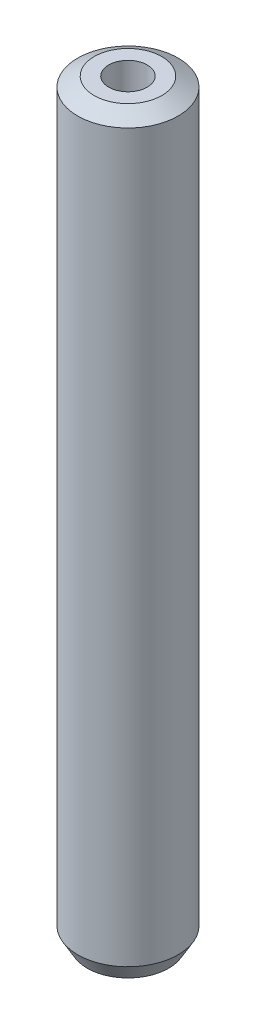
ISO-10303-21;
HEADER;
FILE_DESCRIPTION(('STEP AP214'),'2;1');
FILE_NAME('part.step','',(''),(''),'','','');
FILE_SCHEMA(('AUTOMOTIVE_DESIGN { 1 0 10303 214 1 1 1 1 }'));
ENDSEC;
DATA;
#1=APPLICATION_CONTEXT('core data for automotive mechanical design processes');
#2=APPLICATION_PROTOCOL_DEFINITION('international standard','automotive_design',2000,#1);
#3=PRODUCT_CONTEXT('',#1,'mechanical');
#4=PRODUCT('Part','Part','',(#3));
#5=PRODUCT_RELATED_PRODUCT_CATEGORY('part','',(#4));
#6=PRODUCT_DEFINITION_FORMATION('','',#4);
#7=PRODUCT_DEFINITION_CONTEXT('part definition',#1,'design');
#8=PRODUCT_DEFINITION('design','',#6,#7);
#9=PRODUCT_DEFINITION_SHAPE('','',#8);
#10=(LENGTH_UNIT() NAMED_UNIT(*) SI_UNIT(.MILLI.,.METRE.));
#11=(NAMED_UNIT(*) PLANE_ANGLE_UNIT() SI_UNIT($,.RADIAN.));
#12=(NAMED_UNIT(*) SI_UNIT($,.STERADIAN.) SOLID_ANGLE_UNIT());
#13=UNCERTAINTY_MEASURE_WITH_UNIT(LENGTH_MEASURE(1.E-05),#10,'distance_accuracy_value','');
#14=(GEOMETRIC_REPRESENTATION_CONTEXT(3) GLOBAL_UNCERTAINTY_ASSIGNED_CONTEXT((#13)) GLOBAL_UNIT_ASSIGNED_CONTEXT((#10,
#11,#12)) REPRESENTATION_CONTEXT('',''));
#15=CARTESIAN_POINT('',(0.,0.,0.));
#16=DIRECTION('',(0.,0.,1.));
#17=DIRECTION('',(1.,0.,0.));
#18=AXIS2_PLACEMENT_3D('',#15,#16,#17);
#19=CARTESIAN_POINT('',(0.,74.863959418721,0.));
#20=DIRECTION('',(0.,-1.,0.));
#21=DIRECTION('',(0.,0.,-1.));
#22=AXIS2_PLACEMENT_3D('',#19,#20,#21);
#23=CYLINDRICAL_SURFACE('',#22,5.);
#24=CARTESIAN_POINT('',(0.,73.9192905775556,0.));
#25=DIRECTION('',(0.,1.,0.));
#26=DIRECTION('',(0.,0.,1.));
#27=AXIS2_PLACEMENT_3D('',#24,#25,#26);
#28=CIRCLE('',#27,5.);
#29=CARTESIAN_POINT('',(0.,73.9192905775556,5.));
#30=VERTEX_POINT('',#29);
#31=EDGE_CURVE('E50',#30,#30,#28,.F.);
#32=ORIENTED_EDGE('',*,*,#31,.T.);
#33=EDGE_LOOP('',(#32));
#34=FACE_BOUND('',#33,.T.);
#35=CARTESIAN_POINT('',(0.,1.63621442922553,0.));
#36=DIRECTION('',(0.,1.,0.));
#37=DIRECTION('',(0.,0.,1.));
#38=AXIS2_PLACEMENT_3D('',#35,#36,#37);
#39=CIRCLE('',#38,5.);
#40=CARTESIAN_POINT('',(0.,1.63621442922553,5.));
#41=VERTEX_POINT('',#40);
#42=EDGE_CURVE('E51',#41,#41,#39,.T.);
#43=ORIENTED_EDGE('',*,*,#42,.T.);
#44=EDGE_LOOP('',(#43));
#45=FACE_BOUND('',#44,.T.);
#46=ADVANCED_FACE('F39',(#34,#45),#23,.T.);
#47=CARTESIAN_POINT('',(0.,74.863959418721,0.));
#48=DIRECTION('',(0.,1.,0.));
#49=DIRECTION('',(0.,0.,1.));
#50=AXIS2_PLACEMENT_3D('',#47,#48,#49);
#51=PLANE('',#50);
#52=CARTESIAN_POINT('',(0.,74.863959418721,0.));
#53=DIRECTION('',(0.,1.,0.));
#54=DIRECTION('',(0.,0.,1.));
#55=AXIS2_PLACEMENT_3D('',#52,#53,#54);
#56=CIRCLE('',#55,3.36378557077442);
#57=CARTESIAN_POINT('',(0.,74.863959418721,3.36378557077442));
#58=VERTEX_POINT('',#57);
#59=EDGE_CURVE('E54',#58,#58,#56,.T.);
#60=ORIENTED_EDGE('',*,*,#59,.T.);
#61=EDGE_LOOP('',(#60));
#62=FACE_BOUND('',#61,.T.);
#63=CARTESIAN_POINT('',(0.,74.863959418721,0.));
#64=DIRECTION('',(0.,1.,0.));
#65=DIRECTION('',(0.,0.,1.));
#66=AXIS2_PLACEMENT_3D('',#63,#64,#65);
#67=CIRCLE('',#66,1.91867223052026);
#68=CARTESIAN_POINT('',(0.,74.863959418721,1.91867223052026));
#69=VERTEX_POINT('',#68);
#70=EDGE_CURVE('E58',#69,#69,#67,.T.);
#71=ORIENTED_EDGE('',*,*,#70,.F.);
#72=EDGE_LOOP('',(#71));
#73=FACE_BOUND('',#72,.T.);
#74=ADVANCED_FACE('F69',(#62,#73),#51,.T.);
#75=CARTESIAN_POINT('',(0.,0.,0.));
#76=DIRECTION('',(0.,1.,0.));
#77=DIRECTION('',(0.,0.,1.));
#78=AXIS2_PLACEMENT_3D('',#75,#76,#77);
#79=PLANE('',#78);
#80=CARTESIAN_POINT('',(0.,0.,0.));
#81=DIRECTION('',(0.,1.,0.));
#82=DIRECTION('',(0.,0.,1.));
#83=AXIS2_PLACEMENT_3D('',#80,#81,#82);
#84=CIRCLE('',#83,4.05533115883468);
#85=CARTESIAN_POINT('',(0.,0.,4.05533115883468));
#86=VERTEX_POINT('',#85);
#87=EDGE_CURVE('E10',#86,#86,#84,.F.);
#88=ORIENTED_EDGE('',*,*,#87,.T.);
#89=EDGE_LOOP('',(#88));
#90=FACE_BOUND('',#89,.T.);
#91=CARTESIAN_POINT('',(0.,0.,0.));
#92=DIRECTION('',(0.,1.,0.));
#93=DIRECTION('',(0.,0.,1.));
#94=AXIS2_PLACEMENT_3D('',#91,#92,#93);
#95=CIRCLE('',#94,1.91867223052026);
#96=CARTESIAN_POINT('',(0.,0.,1.91867223052026));
#97=VERTEX_POINT('',#96);
#98=EDGE_CURVE('E63',#97,#97,#95,.T.);
#99=ORIENTED_EDGE('',*,*,#98,.T.);
#100=EDGE_LOOP('',(#99));
#101=FACE_BOUND('',#100,.T.);
#102=ADVANCED_FACE('F75',(#90,#101),#79,.F.);
#103=CARTESIAN_POINT('',(0.,74.863959418721,0.));
#104=DIRECTION('',(0.,-1.,0.));
#105=DIRECTION('',(0.,0.,-1.));
#106=AXIS2_PLACEMENT_3D('',#103,#104,#105);
#107=CYLINDRICAL_SURFACE('',#106,1.91867223052026);
#108=ORIENTED_EDGE('',*,*,#70,.T.);
#109=EDGE_LOOP('',(#108));
#110=FACE_BOUND('',#109,.T.);
#111=ORIENTED_EDGE('',*,*,#98,.F.);
#112=EDGE_LOOP('',(#111));
#113=FACE_BOUND('',#112,.T.);
#114=ADVANCED_FACE('F70',(#110,#113),#107,.F.);
#115=CARTESIAN_POINT('',(0.,74.863959418721,0.));
#116=DIRECTION('',(0.,-1.,0.));
#117=DIRECTION('',(0.,0.,-1.));
#118=AXIS2_PLACEMENT_3D('',#115,#116,#117);
#119=CONICAL_SURFACE('',#118,3.36378557077442,1.0471975511966);
#120=ORIENTED_EDGE('',*,*,#31,.F.);
#121=EDGE_LOOP('',(#120));
#122=FACE_BOUND('',#121,.T.);
#123=ORIENTED_EDGE('',*,*,#59,.F.);
#124=EDGE_LOOP('',(#123));
#125=FACE_BOUND('',#124,.T.);
#126=ADVANCED_FACE('F81',(#122,#125),#119,.T.);
#127=CARTESIAN_POINT('',(0.,1.63621442922553,0.));
#128=DIRECTION('',(0.,1.,0.));
#129=DIRECTION('',(0.,0.,1.));
#130=AXIS2_PLACEMENT_3D('',#127,#128,#129);
#131=CONICAL_SURFACE('',#130,5.,0.523598775598303);
#132=CARTESIAN_POINT('',(0.,0.,4.05533115883468));
#133=CARTESIAN_POINT('',(0.,0.0170439003044324,4.06517145926349));
#134=CARTESIAN_POINT('',(0.,0.0340878006088649,4.07501175969229));
#135=CARTESIAN_POINT('',(0.,0.0681756012177301,4.09469236054991));
#136=CARTESIAN_POINT('',(0.,0.0852195015221626,4.10453266097871));
#137=CARTESIAN_POINT('',(0.,0.119307302131028,4.12421326183632));
#138=CARTESIAN_POINT('',(0.,0.13635120243546,4.13405356226513));
#139=CARTESIAN_POINT('',(0.,0.170439003044326,4.15373416312274));
#140=CARTESIAN_POINT('',(0.,0.187482903348758,4.16357446355154));
#141=CARTESIAN_POINT('',(0.,0.221570703957623,4.18325506440915));
#142=CARTESIAN_POINT('',(0.,0.238614604262056,4.19309536483796));
#143=CARTESIAN_POINT('',(0.,0.272702404870921,4.21277596569557));
#144=CARTESIAN_POINT('',(0.,0.289746305175354,4.22261626612437));
#145=CARTESIAN_POINT('',(0.,0.323834105784219,4.24229686698199));
#146=CARTESIAN_POINT('',(0.,0.340878006088651,4.25213716741079));
#147=CARTESIAN_POINT('',(0.,0.374965806697516,4.2718177682684));
#148=CARTESIAN_POINT('',(0.,0.392009707001949,4.28165806869721));
#149=CARTESIAN_POINT('',(0.,0.426097507610814,4.30133866955482));
#150=CARTESIAN_POINT('',(0.,0.443141407915247,4.31117896998362));
#151=CARTESIAN_POINT('',(0.,0.477229208524112,4.33085957084123));
#152=CARTESIAN_POINT('',(0.,0.494273108828545,4.34069987127004));
#153=CARTESIAN_POINT('',(0.,0.52836090943741,4.36038047212765));
#154=CARTESIAN_POINT('',(0.,0.545404809741842,4.37022077255646));
#155=CARTESIAN_POINT('',(0.,0.579492610350707,4.38990137341407));
#156=CARTESIAN_POINT('',(0.,0.59653651065514,4.39974167384287));
#157=CARTESIAN_POINT('',(0.,0.630624311264005,4.41942227470048));
#158=CARTESIAN_POINT('',(0.,0.647668211568438,4.42926257512929));
#159=CARTESIAN_POINT('',(0.,0.681756012177303,4.4489431759869));
#160=CARTESIAN_POINT('',(0.,0.698799912481735,4.4587834764157));
#161=CARTESIAN_POINT('',(0.,0.732887713090601,4.47846407727331));
#162=CARTESIAN_POINT('',(0.,0.749931613395033,4.48830437770212));
#163=CARTESIAN_POINT('',(0.,0.784019414003898,4.50798497855973));
#164=CARTESIAN_POINT('',(0.,0.801063314308331,4.51782527898854));
#165=CARTESIAN_POINT('',(0.,0.835151114917196,4.53750587984615));
#166=CARTESIAN_POINT('',(0.,0.852195015221629,4.54734618027495));
#167=CARTESIAN_POINT('',(0.,0.886282815830494,4.56702678113256));
#168=CARTESIAN_POINT('',(0.,0.903326716134926,4.57686708156137));
#169=CARTESIAN_POINT('',(0.,0.937414516743791,4.59654768241898));
#170=CARTESIAN_POINT('',(0.,0.954458417048224,4.60638798284779));
#171=CARTESIAN_POINT('',(0.,0.988546217657089,4.6260685837054));
#172=CARTESIAN_POINT('',(0.,1.00559011796152,4.6359088841342));
#173=CARTESIAN_POINT('',(0.,1.03967791857039,4.65558948499181));
#174=CARTESIAN_POINT('',(0.,1.05672181887482,4.66542978542062));
#175=CARTESIAN_POINT('',(0.,1.09080961948368,4.68511038627823));
#176=CARTESIAN_POINT('',(0.,1.10785351978812,4.69495068670703));
#177=CARTESIAN_POINT('',(0.,1.14194132039698,4.71463128756464));
#178=CARTESIAN_POINT('',(0.,1.15898522070141,4.72447158799345));
#179=CARTESIAN_POINT('',(0.,1.19307302131028,4.74415218885106));
#180=CARTESIAN_POINT('',(0.,1.21011692161471,4.75399248927986));
#181=CARTESIAN_POINT('',(0.,1.24420472222358,4.77367309013748));
#182=CARTESIAN_POINT('',(0.,1.26124862252801,4.78351339056628));
#183=CARTESIAN_POINT('',(0.,1.29533642313688,4.80319399142389));
#184=CARTESIAN_POINT('',(0.,1.31238032344131,4.8130342918527));
#185=CARTESIAN_POINT('',(0.,1.34646812405017,4.83271489271031));
#186=CARTESIAN_POINT('',(0.,1.36351202435461,4.84255519313911));
#187=CARTESIAN_POINT('',(0.,1.39759982496347,4.86223579399673));
#188=CARTESIAN_POINT('',(0.,1.4146437252679,4.87207609442553));
#189=CARTESIAN_POINT('',(0.,1.44873152587677,4.89175669528314));
#190=CARTESIAN_POINT('',(0.,1.4657754261812,4.90159699571195));
#191=CARTESIAN_POINT('',(0.,1.49986322679007,4.92127759656956));
#192=CARTESIAN_POINT('',(0.,1.5169071270945,4.93111789699836));
#193=CARTESIAN_POINT('',(0.,1.55099492770336,4.95079849785597));
#194=CARTESIAN_POINT('',(0.,1.5680388280078,4.96063879828478));
#195=CARTESIAN_POINT('',(0.,1.60212662861666,4.98031939914239));
#196=CARTESIAN_POINT('',(0.,1.61917052892109,4.99015969957119));
#197=CARTESIAN_POINT('',(0.,1.63621442922553,5.));
#198=B_SPLINE_CURVE_WITH_KNOTS('',3,(#132,#133,#134,#135,#136,#137,#138,#139,#140,#141,#142,
#143,#144,#145,#146,#147,#148,#149,#150,#151,#152,#153,#154,#155,#156,#157,#158,#159,#160,#161,
#162,#163,#164,#165,#166,#167,#168,#169,#170,#171,#172,#173,#174,#175,#176,#177,#178,#179,#180,
#181,#182,#183,#184,#185,#186,#187,#188,#189,#190,#191,#192,#193,#194,#195,#196,#197),
.UNSPECIFIED.,.F.,.F.,(4,2,2,2,2,2,2,2,2,2,2,2,2,2,2,2,2,2,2,2,2,2,2,2,2,2,2,2,2,2,2,2,4),(0.,
0.0590418025728318,0.118083605145664,0.177125407718495,0.236167210291327,0.295209012864159,
0.354250815436991,0.413292618009823,0.472334420582655,0.531376223155487,0.590418025728318,
0.649459828301151,0.708501630873983,0.767543433446815,0.826585236019646,0.885627038592478,
0.94466884116531,1.00371064373814,1.06275244631097,1.12179424888381,1.18083605145664,
1.23987785402947,1.2989196566023,1.35796145917513,1.41700326174797,1.4760450643208,
1.53508686689363,1.59412866946646,1.65317047203929,1.71221227461213,1.77125407718496,
1.83029587975779,1.88933768233062),.UNSPECIFIED.);
#199=EDGE_CURVE('BSEAM45',#86,#41,#198,.T.);
#200=ORIENTED_EDGE('',*,*,#87,.F.);
#201=ORIENTED_EDGE('',*,*,#42,.F.);
#202=ORIENTED_EDGE('',*,*,#199,.T.);
#203=ORIENTED_EDGE('',*,*,#199,.F.);
#204=EDGE_LOOP('',(#200,#202,#201,#203));
#205=FACE_BOUND('',#204,.T.);
#206=ADVANCED_FACE('F45',(#205),#131,.T.);
#207=CLOSED_SHELL('',(#46,#74,#102,#114,#126,#206));
#208=MANIFOLD_SOLID_BREP('B2',#207);
#209=ADVANCED_BREP_SHAPE_REPRESENTATION('',(#18,#208),#14);
#210=SHAPE_DEFINITION_REPRESENTATION(#9,#209);
ENDSEC;
END-ISO-10303-21;
